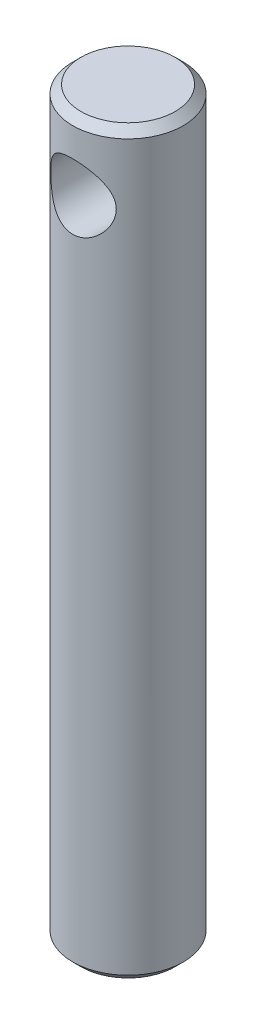
ISO-10303-21;
HEADER;
FILE_DESCRIPTION(('STEP AP214'),'2;1');
FILE_NAME('part.step','',(''),(''),'','','');
FILE_SCHEMA(('AUTOMOTIVE_DESIGN { 1 0 10303 214 1 1 1 1 }'));
ENDSEC;
DATA;
#1=APPLICATION_CONTEXT('core data for automotive mechanical design processes');
#2=APPLICATION_PROTOCOL_DEFINITION('international standard','automotive_design',2000,#1);
#3=PRODUCT_CONTEXT('',#1,'mechanical');
#4=PRODUCT('Part','Part','',(#3));
#5=PRODUCT_RELATED_PRODUCT_CATEGORY('part','',(#4));
#6=PRODUCT_DEFINITION_FORMATION('','',#4);
#7=PRODUCT_DEFINITION_CONTEXT('part definition',#1,'design');
#8=PRODUCT_DEFINITION('design','',#6,#7);
#9=PRODUCT_DEFINITION_SHAPE('','',#8);
#10=(LENGTH_UNIT() NAMED_UNIT(*) SI_UNIT(.MILLI.,.METRE.));
#11=(NAMED_UNIT(*) PLANE_ANGLE_UNIT() SI_UNIT($,.RADIAN.));
#12=(NAMED_UNIT(*) SI_UNIT($,.STERADIAN.) SOLID_ANGLE_UNIT());
#13=UNCERTAINTY_MEASURE_WITH_UNIT(LENGTH_MEASURE(1.E-05),#10,'distance_accuracy_value','');
#14=(GEOMETRIC_REPRESENTATION_CONTEXT(3) GLOBAL_UNCERTAINTY_ASSIGNED_CONTEXT((#13)) GLOBAL_UNIT_ASSIGNED_CONTEXT((#10,
#11,#12)) REPRESENTATION_CONTEXT('',''));
#15=CARTESIAN_POINT('',(0.,0.,0.));
#16=DIRECTION('',(0.,0.,1.));
#17=DIRECTION('',(1.,0.,0.));
#18=AXIS2_PLACEMENT_3D('',#15,#16,#17);
#19=CARTESIAN_POINT('',(0.,181.,0.));
#20=DIRECTION('',(0.,1.,0.));
#21=DIRECTION('',(-1.,0.,0.));
#22=AXIS2_PLACEMENT_3D('',#19,#20,#21);
#23=PLANE('',#22);
#24=CARTESIAN_POINT('',(0.,181.,0.));
#25=DIRECTION('',(0.,-1.,0.));
#26=DIRECTION('',(0.,0.,-1.));
#27=AXIS2_PLACEMENT_3D('',#24,#25,#26);
#28=CIRCLE('',#27,11.5);
#29=CARTESIAN_POINT('',(0.,181.,-11.5));
#30=VERTEX_POINT('',#29);
#31=EDGE_CURVE('E17',#30,#30,#28,.T.);
#32=ORIENTED_EDGE('',*,*,#31,.F.);
#33=EDGE_LOOP('',(#32));
#34=FACE_BOUND('',#33,.T.);
#35=ADVANCED_FACE('F14',(#34),#23,.T.);
#36=CARTESIAN_POINT('',(0.,0.,0.));
#37=DIRECTION('',(0.,1.,0.));
#38=DIRECTION('',(-1.,0.,0.));
#39=AXIS2_PLACEMENT_3D('',#36,#37,#38);
#40=PLANE('',#39);
#41=CARTESIAN_POINT('',(0.,0.,0.));
#42=DIRECTION('',(0.,1.,0.));
#43=DIRECTION('',(0.,0.,1.));
#44=AXIS2_PLACEMENT_3D('',#41,#42,#43);
#45=CIRCLE('',#44,11.5);
#46=CARTESIAN_POINT('',(0.,0.,11.5));
#47=VERTEX_POINT('',#46);
#48=EDGE_CURVE('E61',#47,#47,#45,.T.);
#49=ORIENTED_EDGE('',*,*,#48,.F.);
#50=EDGE_LOOP('',(#49));
#51=FACE_BOUND('',#50,.T.);
#52=ADVANCED_FACE('F71',(#51),#40,.F.);
#53=CARTESIAN_POINT('',(0.,179.,0.));
#54=DIRECTION('',(0.,-1.,0.));
#55=DIRECTION('',(0.,0.,-1.));
#56=AXIS2_PLACEMENT_3D('',#53,#54,#55);
#57=CONICAL_SURFACE('',#56,13.5,0.785398163397452);
#58=CARTESIAN_POINT('',(0.,179.,0.));
#59=DIRECTION('',(0.,-1.,0.));
#60=DIRECTION('',(1.,0.,0.));
#61=AXIS2_PLACEMENT_3D('',#58,#59,#60);
#62=CIRCLE('',#61,13.5);
#63=CARTESIAN_POINT('',(13.5,179.,0.));
#64=VERTEX_POINT('',#63);
#65=EDGE_CURVE('E59',#64,#64,#62,.T.);
#66=ORIENTED_EDGE('',*,*,#65,.F.);
#67=EDGE_LOOP('',(#66));
#68=FACE_BOUND('',#67,.T.);
#69=ORIENTED_EDGE('',*,*,#31,.T.);
#70=EDGE_LOOP('',(#69));
#71=FACE_BOUND('',#70,.T.);
#72=ADVANCED_FACE('F68',(#68,#71),#57,.T.);
#73=CARTESIAN_POINT('',(0.,2.,0.));
#74=DIRECTION('',(0.,1.,0.));
#75=DIRECTION('',(0.,0.,1.));
#76=AXIS2_PLACEMENT_3D('',#73,#74,#75);
#77=CONICAL_SURFACE('',#76,13.5,0.785398163397456);
#78=CARTESIAN_POINT('',(0.,2.,0.));
#79=DIRECTION('',(0.,-1.,0.));
#80=DIRECTION('',(1.,0.,0.));
#81=AXIS2_PLACEMENT_3D('',#78,#79,#80);
#82=CIRCLE('',#81,13.5);
#83=CARTESIAN_POINT('',(13.5,2.,0.));
#84=VERTEX_POINT('',#83);
#85=EDGE_CURVE('E21',#84,#84,#82,.F.);
#86=ORIENTED_EDGE('',*,*,#85,.F.);
#87=EDGE_LOOP('',(#86));
#88=FACE_BOUND('',#87,.T.);
#89=ORIENTED_EDGE('',*,*,#48,.T.);
#90=EDGE_LOOP('',(#89));
#91=FACE_BOUND('',#90,.T.);
#92=ADVANCED_FACE('F50',(#88,#91),#77,.T.);
#93=CARTESIAN_POINT('',(0.,164.,-13.5));
#94=DIRECTION('',(0.,0.,1.));
#95=DIRECTION('',(0.,-1.,0.));
#96=AXIS2_PLACEMENT_3D('',#93,#94,#95);
#97=CYLINDRICAL_SURFACE('',#96,8.00000000000001);
#98=CARTESIAN_POINT('',(0.,156.,-13.5));
#99=CARTESIAN_POINT('',(0.205444811840825,156.000000213052,-13.4999998028401));
#100=CARTESIAN_POINT('',(0.410892907556224,156.007923619556,-13.4952999812257));
#101=CARTESIAN_POINT('',(0.820148719925328,156.039504910253,-13.4766212798122));
#102=CARTESIAN_POINT('',(1.02395640365296,156.063163109478,-13.4626422142295));
#103=CARTESIAN_POINT('',(1.42843209443242,156.12589793438,-13.4257528792139));
#104=CARTESIAN_POINT('',(1.62909894130784,156.164980123929,-13.402839386915));
#105=CARTESIAN_POINT('',(2.02577920716837,156.258054005918,-13.3486440433542));
#106=CARTESIAN_POINT('',(2.22179259438644,156.312045800108,-13.3173621349827));
#107=CARTESIAN_POINT('',(2.60705398416686,156.434028755147,-13.2473182021794));
#108=CARTESIAN_POINT('',(2.79632783029602,156.50195764442,-13.2085894971403));
#109=CARTESIAN_POINT('',(3.16801455611884,156.651270992436,-13.12440539351));
#110=CARTESIAN_POINT('',(3.35042475547244,156.732660642186,-13.0789474005482));
#111=CARTESIAN_POINT('',(3.70738368824763,156.908114449073,-12.9822755174916));
#112=CARTESIAN_POINT('',(3.88193467025749,157.002174949831,-12.9310632885794));
#113=CARTESIAN_POINT('',(4.22254004779814,157.202264548016,-12.8238874895684));
#114=CARTESIAN_POINT('',(4.38859127602468,157.308298060493,-12.767922168664));
#115=CARTESIAN_POINT('',(4.89720636303684,157.660018680492,-12.5858250848827));
#116=CARTESIAN_POINT('',(5.22345968390519,157.926231638982,-12.452929784209));
#117=CARTESIAN_POINT('',(5.82940234184691,158.505093343818,-12.1810760111956));
#118=CARTESIAN_POINT('',(6.10903798051085,158.817794866464,-12.0421107762406));
#119=CARTESIAN_POINT('',(6.50519321607692,159.337653082344,-11.8304070866277));
#120=CARTESIAN_POINT('',(6.63933966345378,159.530696689501,-11.7554370779424));
#121=CARTESIAN_POINT('',(6.89081368974,159.92910716316,-11.6098138352336));
#122=CARTESIAN_POINT('',(7.00813880972212,160.134475825116,-11.5391612331892));
#123=CARTESIAN_POINT('',(7.22478602494542,160.556362067968,-11.4047671714142));
#124=CARTESIAN_POINT('',(7.32412782512049,160.772867108071,-11.3410181783292));
#125=CARTESIAN_POINT('',(7.50379758243892,161.216090708135,-11.2229492942167));
#126=CARTESIAN_POINT('',(7.58413141521898,161.44280608607,-11.1686264908063));
#127=CARTESIAN_POINT('',(7.7108607800257,161.859808921897,-11.0813957740622));
#128=CARTESIAN_POINT('',(7.7608196723252,162.048577263244,-11.0463775742969));
#129=CARTESIAN_POINT('',(7.84700079744403,162.430635865538,-10.9853254966134));
#130=CARTESIAN_POINT('',(7.88322608675389,162.623925110153,-10.959289619745));
#131=CARTESIAN_POINT('',(7.94138400090261,163.013509413913,-10.9172209694655));
#132=CARTESIAN_POINT('',(7.96333239690053,163.209800910308,-10.9011771590228));
#133=CARTESIAN_POINT('',(7.99264065511828,163.604060833353,-10.8797072119521));
#134=CARTESIAN_POINT('',(8.00000016290173,163.802029300628,-10.8742813332862));
#135=CARTESIAN_POINT('',(7.99999983390453,164.201851992616,-10.8742818425894));
#136=CARTESIAN_POINT('',(7.99234858981347,164.40370630571,-10.8799230790568));
#137=CARTESIAN_POINT('',(7.96188172424896,164.805646862828,-10.9022378584408));
#138=CARTESIAN_POINT('',(7.93906565501186,165.005733054469,-10.918911727112));
#139=CARTESIAN_POINT('',(7.87863658901872,165.402647262236,-10.9625940645013));
#140=CARTESIAN_POINT('',(7.84101272785043,165.599472775271,-10.9896101208387));
#141=CARTESIAN_POINT('',(7.75152026305545,165.988411691157,-11.0529150281431));
#142=CARTESIAN_POINT('',(7.69964493931043,166.180522824326,-11.0892082530926));
#143=CARTESIAN_POINT('',(7.58277104370023,166.557384296804,-11.1694476396386));
#144=CARTESIAN_POINT('',(7.51787486438432,166.742179373007,-11.2133337434034));
#145=CARTESIAN_POINT('',(7.37536814454605,167.105154437387,-11.3075746015309));
#146=CARTESIAN_POINT('',(7.29775283919363,167.283331915682,-11.3579317785509));
#147=CARTESIAN_POINT('',(7.1304539293848,167.63236395991,-11.4636993954891));
#148=CARTESIAN_POINT('',(7.04077060082752,167.803218693137,-11.5191097198731));
#149=CARTESIAN_POINT('',(6.84995215478749,168.137047129197,-11.6335968461251));
#150=CARTESIAN_POINT('',(6.74881665350748,168.300020567642,-11.6926737708421));
#151=CARTESIAN_POINT('',(6.40353444050065,168.814336317471,-11.8877905354683));
#152=CARTESIAN_POINT('',(6.13716564490405,169.149457578134,-12.0286820576704));
#153=CARTESIAN_POINT('',(5.70027476265617,169.617165797917,-12.2385939968736));
#154=CARTESIAN_POINT('',(5.54829927206795,169.767334579134,-12.3083765500607));
#155=CARTESIAN_POINT('',(5.23225376625988,170.055510940122,-12.4460104585104));
#156=CARTESIAN_POINT('',(5.06818162863757,170.193516376417,-12.5138614719684));
#157=CARTESIAN_POINT('',(4.71073898594085,170.470338645122,-12.6530429909708));
#158=CARTESIAN_POINT('',(4.51610165634318,170.607715849327,-12.7239895182886));
#159=CARTESIAN_POINT('',(4.11386582068394,170.865355863145,-12.859670528036));
#160=CARTESIAN_POINT('',(3.90627281983044,170.985625871774,-12.9244076197497));
#161=CARTESIAN_POINT('',(3.47941106714835,171.207741366626,-13.0457998025816));
#162=CARTESIAN_POINT('',(3.26015213657196,171.309602043196,-13.1024615487824));
#163=CARTESIAN_POINT('',(2.81134084112887,171.493673710582,-13.2060346652996));
#164=CARTESIAN_POINT('',(2.58179126975604,171.575889996155,-13.2529486624836));
#165=CARTESIAN_POINT('',(2.15987273392328,171.705434636581,-13.3274716834006));
#166=CARTESIAN_POINT('',(1.96897389839794,171.756439414911,-13.3570611114899));
#167=CARTESIAN_POINT('',(1.58291943715922,171.8443315192,-13.4082906280343));
#168=CARTESIAN_POINT('',(1.38776454238827,171.881221249429,-13.4299320702758));
#169=CARTESIAN_POINT('',(0.994597595203241,171.940420595108,-13.4647579384278));
#170=CARTESIAN_POINT('',(0.796586895036518,171.962736893603,-13.4779462407063));
#171=CARTESIAN_POINT('',(0.399051878157935,171.992527062973,-13.4955675816347));
#172=CARTESIAN_POINT('',(0.199527487794575,172.000000206916,-13.5000001914812));
#173=CARTESIAN_POINT('',(-0.205444811840845,171.999999786948,-13.4999998028401));
#174=CARTESIAN_POINT('',(-0.410892907556245,171.992076380444,-13.4952999812257));
#175=CARTESIAN_POINT('',(-0.82014871992535,171.960495089748,-13.4766212798122));
#176=CARTESIAN_POINT('',(-1.02395640365299,171.936836890522,-13.4626422142295));
#177=CARTESIAN_POINT('',(-1.42843209443245,171.87410206562,-13.4257528792139));
#178=CARTESIAN_POINT('',(-1.62909894130786,171.835019876071,-13.402839386915));
#179=CARTESIAN_POINT('',(-2.02577920716839,171.741945994082,-13.3486440433542));
#180=CARTESIAN_POINT('',(-2.22179259438646,171.687954199892,-13.3173621349827));
#181=CARTESIAN_POINT('',(-2.60705398416688,171.565971244853,-13.2473182021794));
#182=CARTESIAN_POINT('',(-2.79632783029603,171.49804235558,-13.2085894971403));
#183=CARTESIAN_POINT('',(-3.16801455611886,171.348729007564,-13.12440539351));
#184=CARTESIAN_POINT('',(-3.35042475547246,171.267339357814,-13.0789474005482));
#185=CARTESIAN_POINT('',(-3.70738368824764,171.091885550927,-12.9822755174916));
#186=CARTESIAN_POINT('',(-3.88193467025749,170.997825050169,-12.9310632885794));
#187=CARTESIAN_POINT('',(-4.22254004779814,170.797735451984,-12.8238874895684));
#188=CARTESIAN_POINT('',(-4.38859127602468,170.691701939507,-12.767922168664));
#189=CARTESIAN_POINT('',(-4.89720636303686,170.339981319508,-12.5858250848827));
#190=CARTESIAN_POINT('',(-5.2234596839052,170.073768361018,-12.452929784209));
#191=CARTESIAN_POINT('',(-5.82940234184692,169.494906656183,-12.1810760111956));
#192=CARTESIAN_POINT('',(-6.10903798051086,169.182205133536,-12.0421107762406));
#193=CARTESIAN_POINT('',(-6.50519321607692,168.662346917656,-11.8304070866277));
#194=CARTESIAN_POINT('',(-6.63933966345377,168.469303310499,-11.7554370779424));
#195=CARTESIAN_POINT('',(-6.89081368973999,168.07089283684,-11.6098138352336));
#196=CARTESIAN_POINT('',(-7.00813880972212,167.865524174884,-11.5391612331892));
#197=CARTESIAN_POINT('',(-7.22478602494542,167.443637932032,-11.4047671714142));
#198=CARTESIAN_POINT('',(-7.32412782512049,167.227132891929,-11.3410181783292));
#199=CARTESIAN_POINT('',(-7.50379758243892,166.783909291865,-11.2229492942167));
#200=CARTESIAN_POINT('',(-7.58413141521898,166.55719391393,-11.1686264908063));
#201=CARTESIAN_POINT('',(-7.71086078002571,166.140191078103,-11.0813957740622));
#202=CARTESIAN_POINT('',(-7.76081967232521,165.951422736756,-11.0463775742969));
#203=CARTESIAN_POINT('',(-7.84700079744404,165.569364134462,-10.9853254966134));
#204=CARTESIAN_POINT('',(-7.8832260867539,165.376074889847,-10.959289619745));
#205=CARTESIAN_POINT('',(-7.94138400090262,164.986490586087,-10.9172209694655));
#206=CARTESIAN_POINT('',(-7.96333239690054,164.790199089692,-10.9011771590228));
#207=CARTESIAN_POINT('',(-7.9926406551183,164.395939166647,-10.8797072119521));
#208=CARTESIAN_POINT('',(-8.00000016290174,164.197970699372,-10.8742813332862));
#209=CARTESIAN_POINT('',(-7.99999983390454,163.798148007384,-10.8742818425894));
#210=CARTESIAN_POINT('',(-7.99234858981347,163.59629369429,-10.8799230790568));
#211=CARTESIAN_POINT('',(-7.96188172424897,163.194353137172,-10.9022378584408));
#212=CARTESIAN_POINT('',(-7.93906565501187,162.994266945531,-10.918911727112));
#213=CARTESIAN_POINT('',(-7.87863658901873,162.597352737764,-10.9625940645013));
#214=CARTESIAN_POINT('',(-7.84101272785044,162.400527224729,-10.9896101208387));
#215=CARTESIAN_POINT('',(-7.75152026305546,162.011588308843,-11.0529150281431));
#216=CARTESIAN_POINT('',(-7.69964493931044,161.819477175674,-11.0892082530926));
#217=CARTESIAN_POINT('',(-7.58277104370024,161.442615703196,-11.1694476396386));
#218=CARTESIAN_POINT('',(-7.51787486438433,161.257820626993,-11.2133337434034));
#219=CARTESIAN_POINT('',(-7.37536814454606,160.894845562613,-11.3075746015309));
#220=CARTESIAN_POINT('',(-7.29775283919364,160.716668084318,-11.3579317785509));
#221=CARTESIAN_POINT('',(-7.13045392938481,160.36763604009,-11.4636993954891));
#222=CARTESIAN_POINT('',(-7.04077060082754,160.196781306863,-11.5191097198731));
#223=CARTESIAN_POINT('',(-6.84995215478751,159.862952870803,-11.6335968461251));
#224=CARTESIAN_POINT('',(-6.74881665350749,159.699979432358,-11.6926737708421));
#225=CARTESIAN_POINT('',(-6.40353444050065,159.185663682529,-11.8877905354683));
#226=CARTESIAN_POINT('',(-6.13716564490406,158.850542421866,-12.0286820576704));
#227=CARTESIAN_POINT('',(-5.70027476265618,158.382834202083,-12.2385939968736));
#228=CARTESIAN_POINT('',(-5.54829927206796,158.232665420866,-12.3083765500607));
#229=CARTESIAN_POINT('',(-5.23225376625989,157.944489059879,-12.4460104585104));
#230=CARTESIAN_POINT('',(-5.06818162863758,157.806483623583,-12.5138614719684));
#231=CARTESIAN_POINT('',(-4.71073898594086,157.529661354878,-12.6530429909707));
#232=CARTESIAN_POINT('',(-4.51610165634318,157.392284150674,-12.7239895182886));
#233=CARTESIAN_POINT('',(-4.11386582068394,157.134644136855,-12.859670528036));
#234=CARTESIAN_POINT('',(-3.90627281983045,157.014374128227,-12.9244076197497));
#235=CARTESIAN_POINT('',(-3.47941106714836,156.792258633374,-13.0457998025816));
#236=CARTESIAN_POINT('',(-3.26015213657197,156.690397956804,-13.1024615487824));
#237=CARTESIAN_POINT('',(-2.81134084112889,156.506326289418,-13.2060346652996));
#238=CARTESIAN_POINT('',(-2.58179126975605,156.424110003845,-13.2529486624836));
#239=CARTESIAN_POINT('',(-2.15987273392329,156.294565363419,-13.3274716834006));
#240=CARTESIAN_POINT('',(-1.96897389839796,156.243560585089,-13.3570611114899));
#241=CARTESIAN_POINT('',(-1.58291943715924,156.155668480801,-13.4082906280343));
#242=CARTESIAN_POINT('',(-1.38776454238828,156.118778750571,-13.4299320702758));
#243=CARTESIAN_POINT('',(-0.994597595203259,156.059579404893,-13.4647579384278));
#244=CARTESIAN_POINT('',(-0.796586895036537,156.037263106397,-13.4779462407063));
#245=CARTESIAN_POINT('',(-0.399051878157955,156.007472937027,-13.4955675816347));
#246=CARTESIAN_POINT('',(-0.199527487794595,155.999999793084,-13.5000001914812));
#247=CARTESIAN_POINT('',(0.,156.,-13.5));
#248=B_SPLINE_CURVE_WITH_KNOTS('',3,(#98,#99,#100,#101,#102,#103,#104,#105,#106,#107,#108,#109,
#110,#111,#112,#113,#114,#115,#116,#117,#118,#119,#120,#121,#122,#123,#124,#125,#126,#127,#128,
#129,#130,#131,#132,#133,#134,#135,#136,#137,#138,#139,#140,#141,#142,#143,#144,#145,#146,#147,
#148,#149,#150,#151,#152,#153,#154,#155,#156,#157,#158,#159,#160,#161,#162,#163,#164,#165,#166,
#167,#168,#169,#170,#171,#172,#173,#174,#175,#176,#177,#178,#179,#180,#181,#182,#183,#184,#185,
#186,#187,#188,#189,#190,#191,#192,#193,#194,#195,#196,#197,#198,#199,#200,#201,#202,#203,#204,
#205,#206,#207,#208,#209,#210,#211,#212,#213,#214,#215,#216,#217,#218,#219,#220,#221,#222,#223,
#224,#225,#226,#227,#228,#229,#230,#231,#232,#233,#234,#235,#236,#237,#238,#239,#240,#241,#242,
#243,#244,#245,#246,#247),.UNSPECIFIED.,.T.,.F.,(4,2,2,2,2,2,2,2,2,2,2,2,2,2,2,2,2,2,2,2,2,2,2,
2,2,2,2,2,2,2,2,2,2,2,2,2,2,2,2,2,2,2,2,2,2,2,2,2,2,2,2,2,2,2,2,2,2,2,2,2,2,2,2,2,2,2,2,2,2,2,2,
2,2,2,4),(0.,0.616135383241036,1.23228310275962,1.84865328772918,2.46502767916691,
3.07870581980915,3.69262117353504,4.30635975003994,4.92032538642526,6.23944568100647,
7.5600751114517,8.2995202016408,9.03907327331405,9.77781102071223,10.5163201144232,
11.1107956669498,11.7051388378245,12.2988243396287,12.892524264819,13.4978639100091,
14.1032214295322,14.7090239276857,15.3151125770182,15.9166097864638,16.5183328456597,
17.1200421505998,17.7217716266256,19.0674381592992,19.7412372252699,20.4151547944674,
21.1599129657236,21.9043567962727,22.6481835207762,23.3918095347546,23.9905461195831,
24.589180673823,25.1875405146294,25.7859296589349,26.402065042176,27.0182127616946,
27.6345829466641,28.2509573381018,28.8646354787441,29.47855083247,30.0922894089748,
30.7062550453602,32.0253753399414,33.3460047703866,34.0854498605757,34.8250029322489,
35.5637406796471,36.3022497733581,36.8967253258847,37.4910684967594,38.0847539985637,
38.6784539237539,39.283793568944,39.8891510884672,40.4949535866206,41.1010422359531,
41.7025394453987,42.3042625045946,42.9059718095347,43.5077012855605,44.8533678182341,
45.5271668842049,46.2010844534024,46.9458426246585,47.6902864552076,48.4341131797112,
49.1777391936896,49.7764757785181,50.3751103327579,50.9734701735643,51.5718593178699),.UNSPECIFIED.);
#249=CARTESIAN_POINT('',(0.,156.,-13.5));
#250=VERTEX_POINT('',#249);
#251=EDGE_CURVE('E10',#250,#250,#248,.T.);
#252=ORIENTED_EDGE('',*,*,#251,.F.);
#253=EDGE_LOOP('',(#252));
#254=FACE_BOUND('',#253,.T.);
#255=CARTESIAN_POINT('',(0.,172.,13.5));
#256=CARTESIAN_POINT('',(0.205444811840831,171.999999786948,13.4999998028401));
#257=CARTESIAN_POINT('',(0.41089290755623,171.992076380444,13.4952999812257));
#258=CARTESIAN_POINT('',(0.820148719925334,171.960495089748,13.4766212798122));
#259=CARTESIAN_POINT('',(1.02395640365297,171.936836890522,13.4626422142295));
#260=CARTESIAN_POINT('',(1.42843209443243,171.87410206562,13.4257528792139));
#261=CARTESIAN_POINT('',(1.62909894130785,171.835019876071,13.402839386915));
#262=CARTESIAN_POINT('',(2.02577920716838,171.741945994082,13.3486440433542));
#263=CARTESIAN_POINT('',(2.22179259438645,171.687954199892,13.3173621349827));
#264=CARTESIAN_POINT('',(2.60705398416687,171.565971244853,13.2473182021794));
#265=CARTESIAN_POINT('',(2.79632783029602,171.49804235558,13.2085894971403));
#266=CARTESIAN_POINT('',(3.16801455611885,171.348729007564,13.12440539351));
#267=CARTESIAN_POINT('',(3.35042475547245,171.267339357814,13.0789474005482));
#268=CARTESIAN_POINT('',(3.70738368824763,171.091885550927,12.9822755174916));
#269=CARTESIAN_POINT('',(3.88193467025748,170.997825050169,12.9310632885794));
#270=CARTESIAN_POINT('',(4.22254004779813,170.797735451984,12.8238874895684));
#271=CARTESIAN_POINT('',(4.38859127602467,170.691701939507,12.767922168664));
#272=CARTESIAN_POINT('',(4.89720636303685,170.339981319508,12.5858250848827));
#273=CARTESIAN_POINT('',(5.2234596839052,170.073768361018,12.452929784209));
#274=CARTESIAN_POINT('',(5.82940234184691,169.494906656183,12.1810760111956));
#275=CARTESIAN_POINT('',(6.10903798051085,169.182205133536,12.0421107762406));
#276=CARTESIAN_POINT('',(6.50519321607691,168.662346917656,11.8304070866277));
#277=CARTESIAN_POINT('',(6.63933966345376,168.469303310499,11.7554370779424));
#278=CARTESIAN_POINT('',(6.89081368973999,168.07089283684,11.6098138352336));
#279=CARTESIAN_POINT('',(7.00813880972212,167.865524174884,11.5391612331892));
#280=CARTESIAN_POINT('',(7.22478602494541,167.443637932032,11.4047671714142));
#281=CARTESIAN_POINT('',(7.32412782512048,167.227132891929,11.3410181783292));
#282=CARTESIAN_POINT('',(7.50379758243891,166.783909291865,11.2229492942168));
#283=CARTESIAN_POINT('',(7.58413141521897,166.55719391393,11.1686264908063));
#284=CARTESIAN_POINT('',(7.7108607800257,166.140191078103,11.0813957740622));
#285=CARTESIAN_POINT('',(7.7608196723252,165.951422736756,11.0463775742969));
#286=CARTESIAN_POINT('',(7.84700079744403,165.569364134462,10.9853254966134));
#287=CARTESIAN_POINT('',(7.88322608675389,165.376074889847,10.959289619745));
#288=CARTESIAN_POINT('',(7.94138400090261,164.986490586087,10.9172209694655));
#289=CARTESIAN_POINT('',(7.96333239690053,164.790199089692,10.9011771590228));
#290=CARTESIAN_POINT('',(7.99264065511828,164.395939166647,10.8797072119521));
#291=CARTESIAN_POINT('',(8.00000016290173,164.197970699372,10.8742813332862));
#292=CARTESIAN_POINT('',(7.99999983390453,163.798148007384,10.8742818425894));
#293=CARTESIAN_POINT('',(7.99234858981346,163.59629369429,10.8799230790568));
#294=CARTESIAN_POINT('',(7.96188172424896,163.194353137172,10.9022378584408));
#295=CARTESIAN_POINT('',(7.93906565501186,162.994266945531,10.918911727112));
#296=CARTESIAN_POINT('',(7.87863658901872,162.597352737764,10.9625940645013));
#297=CARTESIAN_POINT('',(7.84101272785043,162.400527224729,10.9896101208387));
#298=CARTESIAN_POINT('',(7.75152026305545,162.011588308843,11.0529150281431));
#299=CARTESIAN_POINT('',(7.69964493931043,161.819477175674,11.0892082530926));
#300=CARTESIAN_POINT('',(7.58277104370023,161.442615703196,11.1694476396386));
#301=CARTESIAN_POINT('',(7.51787486438432,161.257820626993,11.2133337434034));
#302=CARTESIAN_POINT('',(7.37536814454605,160.894845562613,11.3075746015309));
#303=CARTESIAN_POINT('',(7.29775283919363,160.716668084318,11.3579317785509));
#304=CARTESIAN_POINT('',(7.1304539293848,160.36763604009,11.4636993954891));
#305=CARTESIAN_POINT('',(7.04077060082754,160.196781306863,11.5191097198731));
#306=CARTESIAN_POINT('',(6.8499521547875,159.862952870803,11.6335968461251));
#307=CARTESIAN_POINT('',(6.74881665350749,159.699979432358,11.6926737708421));
#308=CARTESIAN_POINT('',(6.40353444050064,159.185663682529,11.8877905354683));
#309=CARTESIAN_POINT('',(6.13716564490405,158.850542421866,12.0286820576704));
#310=CARTESIAN_POINT('',(5.70027476265617,158.382834202083,12.2385939968736));
#311=CARTESIAN_POINT('',(5.54829927206795,158.232665420866,12.3083765500607));
#312=CARTESIAN_POINT('',(5.23225376625988,157.944489059879,12.4460104585104));
#313=CARTESIAN_POINT('',(5.06818162863757,157.806483623583,12.5138614719684));
#314=CARTESIAN_POINT('',(4.71073898594085,157.529661354878,12.6530429909708));
#315=CARTESIAN_POINT('',(4.51610165634318,157.392284150674,12.7239895182886));
#316=CARTESIAN_POINT('',(4.11386582068394,157.134644136855,12.859670528036));
#317=CARTESIAN_POINT('',(3.90627281983044,157.014374128227,12.9244076197497));
#318=CARTESIAN_POINT('',(3.47941106714835,156.792258633374,13.0457998025816));
#319=CARTESIAN_POINT('',(3.26015213657196,156.690397956804,13.1024615487824));
#320=CARTESIAN_POINT('',(2.81134084112887,156.506326289418,13.2060346652996));
#321=CARTESIAN_POINT('',(2.58179126975604,156.424110003845,13.2529486624836));
#322=CARTESIAN_POINT('',(2.15987273392328,156.294565363419,13.3274716834006));
#323=CARTESIAN_POINT('',(1.96897389839794,156.243560585089,13.3570611114899));
#324=CARTESIAN_POINT('',(1.58291943715923,156.155668480801,13.4082906280343));
#325=CARTESIAN_POINT('',(1.38776454238827,156.118778750571,13.4299320702758));
#326=CARTESIAN_POINT('',(0.99459759520325,156.059579404893,13.4647579384278));
#327=CARTESIAN_POINT('',(0.796586895036528,156.037263106397,13.4779462407063));
#328=CARTESIAN_POINT('',(0.399051878157944,156.007472937027,13.4955675816347));
#329=CARTESIAN_POINT('',(0.199527487794584,155.999999793084,13.5000001914812));
#330=CARTESIAN_POINT('',(-0.205444811840835,156.000000213052,13.4999998028401));
#331=CARTESIAN_POINT('',(-0.410892907556234,156.007923619556,13.4952999812257));
#332=CARTESIAN_POINT('',(-0.820148719925337,156.039504910253,13.4766212798122));
#333=CARTESIAN_POINT('',(-1.02395640365297,156.063163109478,13.4626422142295));
#334=CARTESIAN_POINT('',(-1.42843209443243,156.12589793438,13.4257528792139));
#335=CARTESIAN_POINT('',(-1.62909894130784,156.164980123929,13.402839386915));
#336=CARTESIAN_POINT('',(-2.02577920716837,156.258054005918,13.3486440433542));
#337=CARTESIAN_POINT('',(-2.22179259438644,156.312045800108,13.3173621349827));
#338=CARTESIAN_POINT('',(-2.60705398416687,156.434028755147,13.2473182021794));
#339=CARTESIAN_POINT('',(-2.79632783029603,156.50195764442,13.2085894971403));
#340=CARTESIAN_POINT('',(-3.16801455611885,156.651270992436,13.12440539351));
#341=CARTESIAN_POINT('',(-3.35042475547245,156.732660642186,13.0789474005482));
#342=CARTESIAN_POINT('',(-3.70738368824763,156.908114449073,12.9822755174916));
#343=CARTESIAN_POINT('',(-3.88193467025748,157.002174949831,12.9310632885794));
#344=CARTESIAN_POINT('',(-4.22254004779813,157.202264548016,12.8238874895684));
#345=CARTESIAN_POINT('',(-4.38859127602468,157.308298060493,12.767922168664));
#346=CARTESIAN_POINT('',(-4.89720636303684,157.660018680492,12.5858250848827));
#347=CARTESIAN_POINT('',(-5.22345968390519,157.926231638982,12.452929784209));
#348=CARTESIAN_POINT('',(-5.82940234184691,158.505093343817,12.1810760111956));
#349=CARTESIAN_POINT('',(-6.10903798051086,158.817794866464,12.0421107762406));
#350=CARTESIAN_POINT('',(-6.50519321607692,159.337653082344,11.8304070866277));
#351=CARTESIAN_POINT('',(-6.63933966345376,159.530696689501,11.7554370779424));
#352=CARTESIAN_POINT('',(-6.89081368973998,159.92910716316,11.6098138352336));
#353=CARTESIAN_POINT('',(-7.00813880972211,160.134475825116,11.5391612331892));
#354=CARTESIAN_POINT('',(-7.22478602494542,160.556362067968,11.4047671714142));
#355=CARTESIAN_POINT('',(-7.32412782512049,160.772867108071,11.3410181783292));
#356=CARTESIAN_POINT('',(-7.50379758243892,161.216090708135,11.2229492942167));
#357=CARTESIAN_POINT('',(-7.58413141521898,161.44280608607,11.1686264908063));
#358=CARTESIAN_POINT('',(-7.71086078002571,161.859808921897,11.0813957740622));
#359=CARTESIAN_POINT('',(-7.76081967232521,162.048577263244,11.0463775742969));
#360=CARTESIAN_POINT('',(-7.84700079744403,162.430635865538,10.9853254966134));
#361=CARTESIAN_POINT('',(-7.8832260867539,162.623925110153,10.959289619745));
#362=CARTESIAN_POINT('',(-7.94138400090262,163.013509413913,10.9172209694655));
#363=CARTESIAN_POINT('',(-7.96333239690054,163.209800910308,10.9011771590228));
#364=CARTESIAN_POINT('',(-7.9926406551183,163.604060833353,10.8797072119521));
#365=CARTESIAN_POINT('',(-8.00000016290174,163.802029300628,10.8742813332862));
#366=CARTESIAN_POINT('',(-7.99999983390454,164.201851992616,10.8742818425894));
#367=CARTESIAN_POINT('',(-7.99234858981347,164.40370630571,10.8799230790568));
#368=CARTESIAN_POINT('',(-7.96188172424897,164.805646862828,10.9022378584408));
#369=CARTESIAN_POINT('',(-7.93906565501187,165.005733054469,10.918911727112));
#370=CARTESIAN_POINT('',(-7.87863658901873,165.402647262236,10.9625940645013));
#371=CARTESIAN_POINT('',(-7.84101272785044,165.599472775271,10.9896101208387));
#372=CARTESIAN_POINT('',(-7.75152026305546,165.988411691157,11.0529150281431));
#373=CARTESIAN_POINT('',(-7.69964493931044,166.180522824326,11.0892082530926));
#374=CARTESIAN_POINT('',(-7.58277104370024,166.557384296804,11.1694476396386));
#375=CARTESIAN_POINT('',(-7.51787486438432,166.742179373007,11.2133337434034));
#376=CARTESIAN_POINT('',(-7.37536814454605,167.105154437387,11.3075746015309));
#377=CARTESIAN_POINT('',(-7.29775283919363,167.283331915682,11.3579317785509));
#378=CARTESIAN_POINT('',(-7.13045392938481,167.63236395991,11.4636993954891));
#379=CARTESIAN_POINT('',(-7.04077060082753,167.803218693137,11.5191097198731));
#380=CARTESIAN_POINT('',(-6.8499521547875,168.137047129197,11.6335968461251));
#381=CARTESIAN_POINT('',(-6.74881665350749,168.300020567642,11.6926737708421));
#382=CARTESIAN_POINT('',(-6.40353444050066,168.814336317471,11.8877905354683));
#383=CARTESIAN_POINT('',(-6.13716564490406,169.149457578134,12.0286820576704));
#384=CARTESIAN_POINT('',(-5.70027476265618,169.617165797917,12.2385939968736));
#385=CARTESIAN_POINT('',(-5.54829927206796,169.767334579134,12.3083765500607));
#386=CARTESIAN_POINT('',(-5.23225376625989,170.055510940122,12.4460104585104));
#387=CARTESIAN_POINT('',(-5.06818162863758,170.193516376417,12.5138614719684));
#388=CARTESIAN_POINT('',(-4.71073898594086,170.470338645122,12.6530429909707));
#389=CARTESIAN_POINT('',(-4.51610165634319,170.607715849327,12.7239895182886));
#390=CARTESIAN_POINT('',(-4.11386582068395,170.865355863145,12.859670528036));
#391=CARTESIAN_POINT('',(-3.90627281983045,170.985625871774,12.9244076197497));
#392=CARTESIAN_POINT('',(-3.47941106714836,171.207741366626,13.0457998025816));
#393=CARTESIAN_POINT('',(-3.26015213657197,171.309602043196,13.1024615487824));
#394=CARTESIAN_POINT('',(-2.81134084112889,171.493673710582,13.2060346652996));
#395=CARTESIAN_POINT('',(-2.58179126975605,171.575889996155,13.2529486624836));
#396=CARTESIAN_POINT('',(-2.15987273392329,171.705434636581,13.3274716834006));
#397=CARTESIAN_POINT('',(-1.96897389839796,171.756439414911,13.3570611114899));
#398=CARTESIAN_POINT('',(-1.58291943715924,171.8443315192,13.4082906280343));
#399=CARTESIAN_POINT('',(-1.38776454238828,171.881221249429,13.4299320702758));
#400=CARTESIAN_POINT('',(-0.994597595203257,171.940420595108,13.4647579384278));
#401=CARTESIAN_POINT('',(-0.796586895036533,171.962736893603,13.4779462407063));
#402=CARTESIAN_POINT('',(-0.399051878157949,171.992527062973,13.4955675816347));
#403=CARTESIAN_POINT('',(-0.199527487794589,172.000000206916,13.5000001914812));
#404=CARTESIAN_POINT('',(0.,172.,13.5));
#405=B_SPLINE_CURVE_WITH_KNOTS('',3,(#255,#256,#257,#258,#259,#260,#261,#262,#263,#264,#265,
#266,#267,#268,#269,#270,#271,#272,#273,#274,#275,#276,#277,#278,#279,#280,#281,#282,#283,#284,
#285,#286,#287,#288,#289,#290,#291,#292,#293,#294,#295,#296,#297,#298,#299,#300,#301,#302,#303,
#304,#305,#306,#307,#308,#309,#310,#311,#312,#313,#314,#315,#316,#317,#318,#319,#320,#321,#322,
#323,#324,#325,#326,#327,#328,#329,#330,#331,#332,#333,#334,#335,#336,#337,#338,#339,#340,#341,
#342,#343,#344,#345,#346,#347,#348,#349,#350,#351,#352,#353,#354,#355,#356,#357,#358,#359,#360,
#361,#362,#363,#364,#365,#366,#367,#368,#369,#370,#371,#372,#373,#374,#375,#376,#377,#378,#379,
#380,#381,#382,#383,#384,#385,#386,#387,#388,#389,#390,#391,#392,#393,#394,#395,#396,#397,#398,
#399,#400,#401,#402,#403,#404),.UNSPECIFIED.,.T.,.F.,(4,2,2,2,2,2,2,2,2,2,2,2,2,2,2,2,2,2,2,2,2,
2,2,2,2,2,2,2,2,2,2,2,2,2,2,2,2,2,2,2,2,2,2,2,2,2,2,2,2,2,2,2,2,2,2,2,2,2,2,2,2,2,2,2,2,2,2,2,2,
2,2,2,2,2,4),(0.,0.616135383241037,1.23228310275962,1.84865328772918,2.46502767916691,
3.07870581980915,3.69262117353504,4.30635975003992,4.92032538642526,6.23944568100647,
7.56007511145169,8.29952020164075,9.03907327331402,9.7778110207122,10.5163201144232,
11.1107956669498,11.7051388378245,12.2988243396287,12.892524264819,13.4978639100091,
14.1032214295322,14.7090239276857,15.3151125770182,15.9166097864638,16.5183328456597,
17.1200421505997,17.7217716266255,19.0674381592992,19.7412372252699,20.4151547944674,
21.1599129657236,21.9043567962727,22.6481835207762,23.3918095347546,23.9905461195831,
24.589180673823,25.1875405146294,25.7859296589349,26.402065042176,27.0182127616945,
27.6345829466641,28.2509573381018,28.8646354787441,29.47855083247,30.0922894089748,
30.7062550453602,32.0253753399414,33.3460047703866,34.0854498605757,34.8250029322489,
35.5637406796471,36.3022497733581,36.8967253258847,37.4910684967594,38.0847539985636,
38.6784539237539,39.283793568944,39.8891510884672,40.4949535866206,41.1010422359531,
41.7025394453987,42.3042625045946,42.9059718095347,43.5077012855605,44.8533678182341,
45.5271668842049,46.2010844534024,46.9458426246585,47.6902864552076,48.4341131797112,
49.1777391936896,49.7764757785181,50.3751103327579,50.9734701735644,51.5718593178699),.UNSPECIFIED.);
#406=CARTESIAN_POINT('',(0.,172.,13.5));
#407=VERTEX_POINT('',#406);
#408=EDGE_CURVE('E26',#407,#407,#405,.T.);
#409=ORIENTED_EDGE('',*,*,#408,.F.);
#410=EDGE_LOOP('',(#409));
#411=FACE_BOUND('',#410,.T.);
#412=ADVANCED_FACE('F38',(#254,#411),#97,.F.);
#413=CARTESIAN_POINT('',(0.,181.,0.));
#414=DIRECTION('',(0.,-1.,0.));
#415=DIRECTION('',(1.,0.,0.));
#416=AXIS2_PLACEMENT_3D('',#413,#414,#415);
#417=CYLINDRICAL_SURFACE('',#416,13.5);
#418=ORIENTED_EDGE('',*,*,#408,.T.);
#419=EDGE_LOOP('',(#418));
#420=FACE_BOUND('',#419,.T.);
#421=ORIENTED_EDGE('',*,*,#85,.T.);
#422=EDGE_LOOP('',(#421));
#423=FACE_BOUND('',#422,.T.);
#424=ORIENTED_EDGE('',*,*,#251,.T.);
#425=EDGE_LOOP('',(#424));
#426=FACE_BOUND('',#425,.T.);
#427=ORIENTED_EDGE('',*,*,#65,.T.);
#428=EDGE_LOOP('',(#427));
#429=FACE_BOUND('',#428,.T.);
#430=ADVANCED_FACE('F41',(#420,#423,#426,#429),#417,.T.);
#431=CLOSED_SHELL('',(#35,#52,#72,#92,#412,#430));
#432=MANIFOLD_SOLID_BREP('B1',#431);
#433=ADVANCED_BREP_SHAPE_REPRESENTATION('',(#18,#432),#14);
#434=SHAPE_DEFINITION_REPRESENTATION(#9,#433);
ENDSEC;
END-ISO-10303-21;
